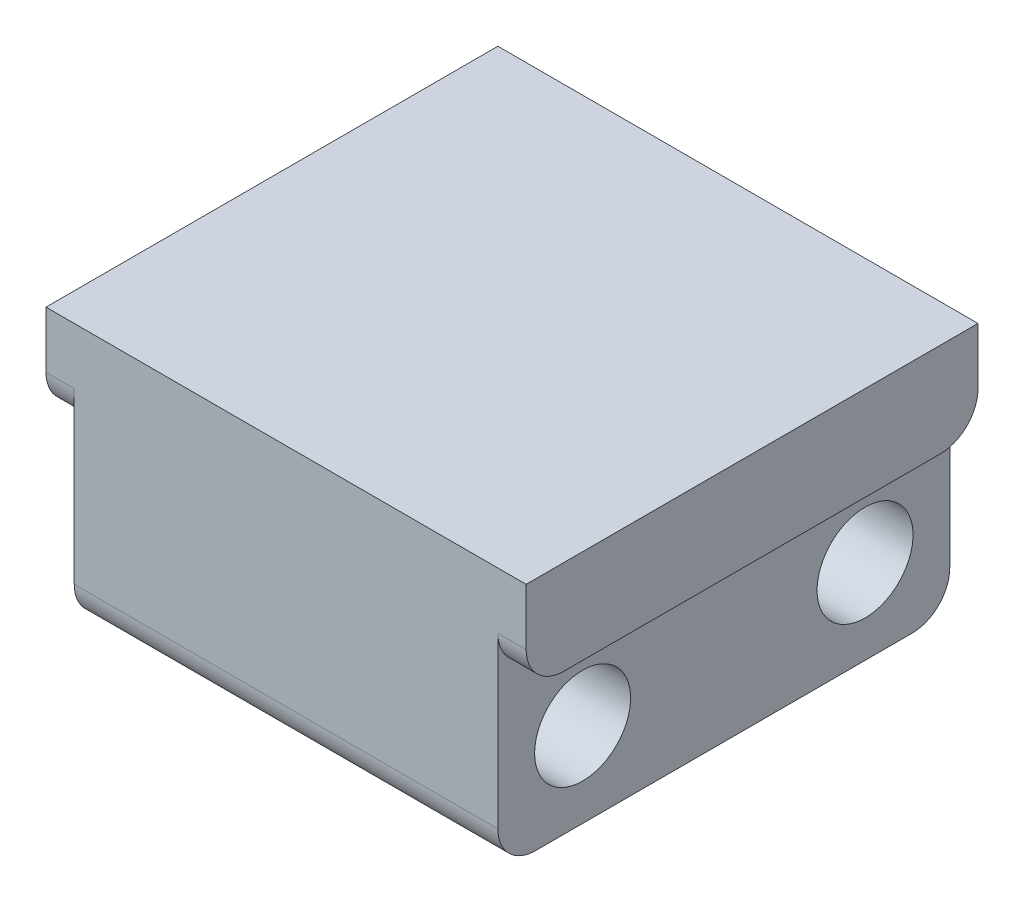
ISO-10303-21;
HEADER;
FILE_DESCRIPTION(('STEP AP214'),'2;1');
FILE_NAME('part.step','',(''),(''),'','','');
FILE_SCHEMA(('AUTOMOTIVE_DESIGN { 1 0 10303 214 1 1 1 1 }'));
ENDSEC;
DATA;
#1=APPLICATION_CONTEXT('core data for automotive mechanical design processes');
#2=APPLICATION_PROTOCOL_DEFINITION('international standard','automotive_design',2000,#1);
#3=PRODUCT_CONTEXT('',#1,'mechanical');
#4=PRODUCT('Part','Part','',(#3));
#5=PRODUCT_RELATED_PRODUCT_CATEGORY('part','',(#4));
#6=PRODUCT_DEFINITION_FORMATION('','',#4);
#7=PRODUCT_DEFINITION_CONTEXT('part definition',#1,'design');
#8=PRODUCT_DEFINITION('design','',#6,#7);
#9=PRODUCT_DEFINITION_SHAPE('','',#8);
#10=(LENGTH_UNIT() NAMED_UNIT(*) SI_UNIT(.MILLI.,.METRE.));
#11=(NAMED_UNIT(*) PLANE_ANGLE_UNIT() SI_UNIT($,.RADIAN.));
#12=(NAMED_UNIT(*) SI_UNIT($,.STERADIAN.) SOLID_ANGLE_UNIT());
#13=UNCERTAINTY_MEASURE_WITH_UNIT(LENGTH_MEASURE(1.E-05),#10,'distance_accuracy_value','');
#14=(GEOMETRIC_REPRESENTATION_CONTEXT(3) GLOBAL_UNCERTAINTY_ASSIGNED_CONTEXT((#13)) GLOBAL_UNIT_ASSIGNED_CONTEXT((#10,
#11,#12)) REPRESENTATION_CONTEXT('',''));
#15=CARTESIAN_POINT('',(0.,0.,0.));
#16=DIRECTION('',(0.,0.,1.));
#17=DIRECTION('',(1.,0.,0.));
#18=AXIS2_PLACEMENT_3D('',#15,#16,#17);
#19=CARTESIAN_POINT('',(11.25,9.,12.));
#20=DIRECTION('',(0.,1.,0.));
#21=DIRECTION('',(0.,0.,1.));
#22=AXIS2_PLACEMENT_3D('',#19,#20,#21);
#23=PLANE('',#22);
#24=DIRECTION('',(0.,0.,-1.));
#25=VECTOR('',#24,1.);
#26=CARTESIAN_POINT('',(12.75,9.,12.));
#27=LINE('',#26,#25);
#28=CARTESIAN_POINT('',(12.75,9.,10.));
#29=VERTEX_POINT('',#28);
#30=CARTESIAN_POINT('',(12.75,9.,-10.));
#31=VERTEX_POINT('',#30);
#32=EDGE_CURVE('E154',#29,#31,#27,.T.);
#33=ORIENTED_EDGE('',*,*,#32,.F.);
#34=DIRECTION('',(1.,0.,0.));
#35=VECTOR('',#34,1.);
#36=CARTESIAN_POINT('',(11.25,9.,10.));
#37=LINE('',#36,#35);
#38=CARTESIAN_POINT('',(11.25,9.,10.));
#39=VERTEX_POINT('',#38);
#40=EDGE_CURVE('E218',#29,#39,#37,.F.);
#41=ORIENTED_EDGE('',*,*,#40,.T.);
#42=DIRECTION('',(0.,0.,-1.));
#43=VECTOR('',#42,1.);
#44=CARTESIAN_POINT('',(11.25,9.,12.));
#45=LINE('',#44,#43);
#46=CARTESIAN_POINT('',(11.25,9.,-10.));
#47=VERTEX_POINT('',#46);
#48=EDGE_CURVE('E170',#39,#47,#45,.T.);
#49=ORIENTED_EDGE('',*,*,#48,.T.);
#50=DIRECTION('',(1.,0.,0.));
#51=VECTOR('',#50,1.);
#52=CARTESIAN_POINT('',(11.25,9.,-10.));
#53=LINE('',#52,#51);
#54=EDGE_CURVE('E215',#47,#31,#53,.T.);
#55=ORIENTED_EDGE('',*,*,#54,.T.);
#56=EDGE_LOOP('',(#33,#41,#49,#55));
#57=FACE_BOUND('',#56,.T.);
#58=ADVANCED_FACE('F32',(#57),#23,.F.);
#59=CARTESIAN_POINT('',(12.75,9.,12.));
#60=DIRECTION('',(-1.,0.,0.));
#61=DIRECTION('',(0.,0.,1.));
#62=AXIS2_PLACEMENT_3D('',#59,#60,#61);
#63=PLANE('',#62);
#64=DIRECTION('',(0.,1.,0.));
#65=VECTOR('',#64,1.);
#66=CARTESIAN_POINT('',(12.75,9.,12.));
#67=LINE('',#66,#65);
#68=CARTESIAN_POINT('',(12.75,11.,12.));
#69=VERTEX_POINT('',#68);
#70=CARTESIAN_POINT('',(12.75,14.,12.));
#71=VERTEX_POINT('',#70);
#72=EDGE_CURVE('E135',#69,#71,#67,.T.);
#73=ORIENTED_EDGE('',*,*,#72,.F.);
#74=CARTESIAN_POINT('',(12.75,11.,10.));
#75=DIRECTION('',(-1.,0.,0.));
#76=DIRECTION('',(0.,0.,1.));
#77=AXIS2_PLACEMENT_3D('',#74,#75,#76);
#78=CIRCLE('',#77,2.);
#79=EDGE_CURVE('E213',#69,#29,#78,.F.);
#80=ORIENTED_EDGE('',*,*,#79,.T.);
#81=ORIENTED_EDGE('',*,*,#32,.T.);
#82=CARTESIAN_POINT('',(12.75,11.,-10.));
#83=DIRECTION('',(-1.,0.,0.));
#84=DIRECTION('',(0.,0.,1.));
#85=AXIS2_PLACEMENT_3D('',#82,#83,#84);
#86=CIRCLE('',#85,2.);
#87=CARTESIAN_POINT('',(12.75,11.,-12.));
#88=VERTEX_POINT('',#87);
#89=EDGE_CURVE('E211',#31,#88,#86,.F.);
#90=ORIENTED_EDGE('',*,*,#89,.T.);
#91=DIRECTION('',(0.,1.,0.));
#92=VECTOR('',#91,1.);
#93=CARTESIAN_POINT('',(12.75,9.,-12.));
#94=LINE('',#93,#92);
#95=CARTESIAN_POINT('',(12.75,14.,-12.));
#96=VERTEX_POINT('',#95);
#97=EDGE_CURVE('E151',#88,#96,#94,.T.);
#98=ORIENTED_EDGE('',*,*,#97,.T.);
#99=DIRECTION('',(0.,0.,-1.));
#100=VECTOR('',#99,1.);
#101=CARTESIAN_POINT('',(12.75,14.,12.));
#102=LINE('',#101,#100);
#103=EDGE_CURVE('E148',#71,#96,#102,.T.);
#104=ORIENTED_EDGE('',*,*,#103,.F.);
#105=EDGE_LOOP('',(#73,#80,#81,#90,#98,#104));
#106=FACE_BOUND('',#105,.T.);
#107=ADVANCED_FACE('F149',(#106),#63,.F.);
#108=CARTESIAN_POINT('',(-12.75,14.,12.));
#109=DIRECTION('',(0.,-1.,0.));
#110=DIRECTION('',(0.,0.,-1.));
#111=AXIS2_PLACEMENT_3D('',#108,#109,#110);
#112=PLANE('',#111);
#113=DIRECTION('',(-1.,0.,0.));
#114=VECTOR('',#113,1.);
#115=CARTESIAN_POINT('',(-12.75,14.,-12.));
#116=LINE('',#115,#114);
#117=CARTESIAN_POINT('',(-12.75,14.,-12.));
#118=VERTEX_POINT('',#117);
#119=EDGE_CURVE('E172',#96,#118,#116,.T.);
#120=ORIENTED_EDGE('',*,*,#119,.T.);
#121=DIRECTION('',(0.,0.,-1.));
#122=VECTOR('',#121,1.);
#123=CARTESIAN_POINT('',(-12.75,14.,12.));
#124=LINE('',#123,#122);
#125=CARTESIAN_POINT('',(-12.75,14.,12.));
#126=VERTEX_POINT('',#125);
#127=EDGE_CURVE('E155',#126,#118,#124,.T.);
#128=ORIENTED_EDGE('',*,*,#127,.F.);
#129=DIRECTION('',(-1.,0.,0.));
#130=VECTOR('',#129,1.);
#131=CARTESIAN_POINT('',(-12.75,14.,12.));
#132=LINE('',#131,#130);
#133=EDGE_CURVE('E140',#71,#126,#132,.T.);
#134=ORIENTED_EDGE('',*,*,#133,.F.);
#135=ORIENTED_EDGE('',*,*,#103,.T.);
#136=EDGE_LOOP('',(#120,#128,#134,#135));
#137=FACE_BOUND('',#136,.T.);
#138=ADVANCED_FACE('F157',(#137),#112,.F.);
#139=CARTESIAN_POINT('',(-12.75,9.,12.));
#140=DIRECTION('',(1.,0.,0.));
#141=DIRECTION('',(0.,0.,-1.));
#142=AXIS2_PLACEMENT_3D('',#139,#140,#141);
#143=PLANE('',#142);
#144=DIRECTION('',(0.,0.,-1.));
#145=VECTOR('',#144,1.);
#146=CARTESIAN_POINT('',(-12.75,9.,12.));
#147=LINE('',#146,#145);
#148=CARTESIAN_POINT('',(-12.75,9.,10.));
#149=VERTEX_POINT('',#148);
#150=CARTESIAN_POINT('',(-12.75,9.,-10.));
#151=VERTEX_POINT('',#150);
#152=EDGE_CURVE('E191',#149,#151,#147,.T.);
#153=ORIENTED_EDGE('',*,*,#152,.F.);
#154=CARTESIAN_POINT('',(-12.75,11.,10.));
#155=DIRECTION('',(1.,0.,0.));
#156=DIRECTION('',(0.,0.,-1.));
#157=AXIS2_PLACEMENT_3D('',#154,#155,#156);
#158=CIRCLE('',#157,2.);
#159=CARTESIAN_POINT('',(-12.75,11.,12.));
#160=VERTEX_POINT('',#159);
#161=EDGE_CURVE('E227',#149,#160,#158,.F.);
#162=ORIENTED_EDGE('',*,*,#161,.T.);
#163=DIRECTION('',(0.,-1.,0.));
#164=VECTOR('',#163,1.);
#165=CARTESIAN_POINT('',(-12.75,9.,12.));
#166=LINE('',#165,#164);
#167=EDGE_CURVE('E160',#126,#160,#166,.T.);
#168=ORIENTED_EDGE('',*,*,#167,.F.);
#169=ORIENTED_EDGE('',*,*,#127,.T.);
#170=DIRECTION('',(0.,-1.,0.));
#171=VECTOR('',#170,1.);
#172=CARTESIAN_POINT('',(-12.75,9.,-12.));
#173=LINE('',#172,#171);
#174=CARTESIAN_POINT('',(-12.75,11.,-12.));
#175=VERTEX_POINT('',#174);
#176=EDGE_CURVE('E175',#118,#175,#173,.T.);
#177=ORIENTED_EDGE('',*,*,#176,.T.);
#178=CARTESIAN_POINT('',(-12.75,11.,-10.));
#179=DIRECTION('',(1.,0.,0.));
#180=DIRECTION('',(0.,0.,-1.));
#181=AXIS2_PLACEMENT_3D('',#178,#179,#180);
#182=CIRCLE('',#181,2.);
#183=EDGE_CURVE('E225',#175,#151,#182,.F.);
#184=ORIENTED_EDGE('',*,*,#183,.T.);
#185=EDGE_LOOP('',(#153,#162,#168,#169,#177,#184));
#186=FACE_BOUND('',#185,.T.);
#187=ADVANCED_FACE('F269',(#186),#143,.F.);
#188=CARTESIAN_POINT('',(-11.25,9.,12.));
#189=DIRECTION('',(0.,1.,0.));
#190=DIRECTION('',(0.,0.,1.));
#191=AXIS2_PLACEMENT_3D('',#188,#189,#190);
#192=PLANE('',#191);
#193=DIRECTION('',(0.,0.,-1.));
#194=VECTOR('',#193,1.);
#195=CARTESIAN_POINT('',(-11.25,9.,12.));
#196=LINE('',#195,#194);
#197=CARTESIAN_POINT('',(-11.25,9.,10.));
#198=VERTEX_POINT('',#197);
#199=CARTESIAN_POINT('',(-11.25,9.,-10.));
#200=VERTEX_POINT('',#199);
#201=EDGE_CURVE('E188',#198,#200,#196,.T.);
#202=ORIENTED_EDGE('',*,*,#201,.F.);
#203=DIRECTION('',(1.,0.,0.));
#204=VECTOR('',#203,1.);
#205=CARTESIAN_POINT('',(-12.75,9.,10.));
#206=LINE('',#205,#204);
#207=EDGE_CURVE('E223',#198,#149,#206,.F.);
#208=ORIENTED_EDGE('',*,*,#207,.T.);
#209=ORIENTED_EDGE('',*,*,#152,.T.);
#210=DIRECTION('',(1.,0.,0.));
#211=VECTOR('',#210,1.);
#212=CARTESIAN_POINT('',(-11.25,9.,-10.));
#213=LINE('',#212,#211);
#214=EDGE_CURVE('E220',#151,#200,#213,.T.);
#215=ORIENTED_EDGE('',*,*,#214,.T.);
#216=EDGE_LOOP('',(#202,#208,#209,#215));
#217=FACE_BOUND('',#216,.T.);
#218=ADVANCED_FACE('F280',(#217),#192,.F.);
#219=CARTESIAN_POINT('',(-11.25,0.,12.));
#220=DIRECTION('',(1.,0.,0.));
#221=DIRECTION('',(0.,0.,-1.));
#222=AXIS2_PLACEMENT_3D('',#219,#220,#221);
#223=PLANE('',#222);
#224=CARTESIAN_POINT('',(-11.25,4.5,7.5));
#225=DIRECTION('',(-1.,0.,0.));
#226=DIRECTION('',(0.,0.,1.));
#227=AXIS2_PLACEMENT_3D('',#224,#225,#226);
#228=CIRCLE('',#227,2.55);
#229=CARTESIAN_POINT('',(-11.25,4.5,10.05));
#230=VERTEX_POINT('',#229);
#231=EDGE_CURVE('E204',#230,#230,#228,.T.);
#232=ORIENTED_EDGE('',*,*,#231,.F.);
#233=EDGE_LOOP('',(#232));
#234=FACE_BOUND('',#233,.T.);
#235=CARTESIAN_POINT('',(-11.25,4.5,-7.5));
#236=DIRECTION('',(-1.,0.,0.));
#237=DIRECTION('',(0.,0.,1.));
#238=AXIS2_PLACEMENT_3D('',#235,#236,#237);
#239=CIRCLE('',#238,2.55);
#240=CARTESIAN_POINT('',(-11.25,4.5,-4.95));
#241=VERTEX_POINT('',#240);
#242=EDGE_CURVE('E200',#241,#241,#239,.T.);
#243=ORIENTED_EDGE('',*,*,#242,.F.);
#244=EDGE_LOOP('',(#243));
#245=FACE_BOUND('',#244,.T.);
#246=DIRECTION('',(0.,-1.,0.));
#247=VECTOR('',#246,1.);
#248=CARTESIAN_POINT('',(-11.25,0.,-12.));
#249=LINE('',#248,#247);
#250=CARTESIAN_POINT('',(-11.25,11.,-12.));
#251=VERTEX_POINT('',#250);
#252=CARTESIAN_POINT('',(-11.25,2.,-12.));
#253=VERTEX_POINT('',#252);
#254=EDGE_CURVE('E178',#251,#253,#249,.T.);
#255=ORIENTED_EDGE('',*,*,#254,.T.);
#256=CARTESIAN_POINT('',(-11.25,2.,-10.));
#257=DIRECTION('',(1.,0.,0.));
#258=DIRECTION('',(0.,0.,-1.));
#259=AXIS2_PLACEMENT_3D('',#256,#257,#258);
#260=CIRCLE('',#259,2.);
#261=CARTESIAN_POINT('',(-11.25,0.,-10.));
#262=VERTEX_POINT('',#261);
#263=EDGE_CURVE('E47',#253,#262,#260,.F.);
#264=ORIENTED_EDGE('',*,*,#263,.T.);
#265=DIRECTION('',(0.,0.,-1.));
#266=VECTOR('',#265,1.);
#267=CARTESIAN_POINT('',(-11.25,0.,12.));
#268=LINE('',#267,#266);
#269=CARTESIAN_POINT('',(-11.25,0.,10.));
#270=VERTEX_POINT('',#269);
#271=EDGE_CURVE('E186',#270,#262,#268,.T.);
#272=ORIENTED_EDGE('',*,*,#271,.F.);
#273=CARTESIAN_POINT('',(-11.25,2.,10.));
#274=DIRECTION('',(1.,0.,0.));
#275=DIRECTION('',(0.,0.,-1.));
#276=AXIS2_PLACEMENT_3D('',#273,#274,#275);
#277=CIRCLE('',#276,2.);
#278=CARTESIAN_POINT('',(-11.25,2.,12.));
#279=VERTEX_POINT('',#278);
#280=EDGE_CURVE('E244',#270,#279,#277,.F.);
#281=ORIENTED_EDGE('',*,*,#280,.T.);
#282=DIRECTION('',(0.,-1.,0.));
#283=VECTOR('',#282,1.);
#284=CARTESIAN_POINT('',(-11.25,0.,12.));
#285=LINE('',#284,#283);
#286=CARTESIAN_POINT('',(-11.25,11.,12.));
#287=VERTEX_POINT('',#286);
#288=EDGE_CURVE('E162',#287,#279,#285,.T.);
#289=ORIENTED_EDGE('',*,*,#288,.F.);
#290=CARTESIAN_POINT('',(-11.25,11.,10.));
#291=DIRECTION('',(1.,0.,0.));
#292=DIRECTION('',(0.,0.,-1.));
#293=AXIS2_PLACEMENT_3D('',#290,#291,#292);
#294=CIRCLE('',#293,2.);
#295=EDGE_CURVE('E250',#287,#198,#294,.T.);
#296=ORIENTED_EDGE('',*,*,#295,.T.);
#297=ORIENTED_EDGE('',*,*,#201,.T.);
#298=CARTESIAN_POINT('',(-11.25,11.,-10.));
#299=DIRECTION('',(1.,0.,0.));
#300=DIRECTION('',(0.,0.,-1.));
#301=AXIS2_PLACEMENT_3D('',#298,#299,#300);
#302=CIRCLE('',#301,2.);
#303=EDGE_CURVE('E11',#200,#251,#302,.T.);
#304=ORIENTED_EDGE('',*,*,#303,.T.);
#305=EDGE_LOOP('',(#255,#264,#272,#281,#289,#296,#297,#304));
#306=FACE_BOUND('',#305,.T.);
#307=ADVANCED_FACE('F278',(#234,#245,#306),#223,.F.);
#308=CARTESIAN_POINT('',(11.25,0.,12.));
#309=DIRECTION('',(0.,1.,0.));
#310=DIRECTION('',(0.,0.,1.));
#311=AXIS2_PLACEMENT_3D('',#308,#309,#310);
#312=PLANE('',#311);
#313=ORIENTED_EDGE('',*,*,#271,.T.);
#314=DIRECTION('',(1.,0.,0.));
#315=VECTOR('',#314,1.);
#316=CARTESIAN_POINT('',(11.25,0.,-10.));
#317=LINE('',#316,#315);
#318=CARTESIAN_POINT('',(11.25,0.,-10.));
#319=VERTEX_POINT('',#318);
#320=EDGE_CURVE('E237',#262,#319,#317,.T.);
#321=ORIENTED_EDGE('',*,*,#320,.T.);
#322=DIRECTION('',(0.,0.,-1.));
#323=VECTOR('',#322,1.);
#324=CARTESIAN_POINT('',(11.25,0.,12.));
#325=LINE('',#324,#323);
#326=CARTESIAN_POINT('',(11.25,0.,10.));
#327=VERTEX_POINT('',#326);
#328=EDGE_CURVE('E183',#327,#319,#325,.T.);
#329=ORIENTED_EDGE('',*,*,#328,.F.);
#330=DIRECTION('',(1.,0.,0.));
#331=VECTOR('',#330,1.);
#332=CARTESIAN_POINT('',(-11.25,0.,10.));
#333=LINE('',#332,#331);
#334=EDGE_CURVE('E54',#327,#270,#333,.F.);
#335=ORIENTED_EDGE('',*,*,#334,.T.);
#336=EDGE_LOOP('',(#313,#321,#329,#335));
#337=FACE_BOUND('',#336,.T.);
#338=ADVANCED_FACE('F289',(#337),#312,.F.);
#339=CARTESIAN_POINT('',(11.25,0.,12.));
#340=DIRECTION('',(-1.,0.,0.));
#341=DIRECTION('',(0.,0.,1.));
#342=AXIS2_PLACEMENT_3D('',#339,#340,#341);
#343=PLANE('',#342);
#344=CARTESIAN_POINT('',(11.25,4.5,7.5));
#345=DIRECTION('',(-1.,0.,0.));
#346=DIRECTION('',(0.,0.,1.));
#347=AXIS2_PLACEMENT_3D('',#344,#345,#346);
#348=CIRCLE('',#347,2.55);
#349=CARTESIAN_POINT('',(11.25,4.5,10.05));
#350=VERTEX_POINT('',#349);
#351=EDGE_CURVE('E201',#350,#350,#348,.T.);
#352=ORIENTED_EDGE('',*,*,#351,.T.);
#353=EDGE_LOOP('',(#352));
#354=FACE_BOUND('',#353,.T.);
#355=CARTESIAN_POINT('',(11.25,4.5,-7.5));
#356=DIRECTION('',(-1.,0.,0.));
#357=DIRECTION('',(0.,0.,1.));
#358=AXIS2_PLACEMENT_3D('',#355,#356,#357);
#359=CIRCLE('',#358,2.55);
#360=CARTESIAN_POINT('',(11.25,4.5,-4.95));
#361=VERTEX_POINT('',#360);
#362=EDGE_CURVE('E173',#361,#361,#359,.T.);
#363=ORIENTED_EDGE('',*,*,#362,.T.);
#364=EDGE_LOOP('',(#363));
#365=FACE_BOUND('',#364,.T.);
#366=ORIENTED_EDGE('',*,*,#328,.T.);
#367=CARTESIAN_POINT('',(11.25,2.,-10.));
#368=DIRECTION('',(-1.,0.,0.));
#369=DIRECTION('',(0.,0.,1.));
#370=AXIS2_PLACEMENT_3D('',#367,#368,#369);
#371=CIRCLE('',#370,2.);
#372=CARTESIAN_POINT('',(11.25,2.,-12.));
#373=VERTEX_POINT('',#372);
#374=EDGE_CURVE('E242',#319,#373,#371,.F.);
#375=ORIENTED_EDGE('',*,*,#374,.T.);
#376=DIRECTION('',(0.,1.,0.));
#377=VECTOR('',#376,1.);
#378=CARTESIAN_POINT('',(11.25,0.,-12.));
#379=LINE('',#378,#377);
#380=CARTESIAN_POINT('',(11.25,11.,-12.));
#381=VERTEX_POINT('',#380);
#382=EDGE_CURVE('E145',#373,#381,#379,.T.);
#383=ORIENTED_EDGE('',*,*,#382,.T.);
#384=CARTESIAN_POINT('',(11.25,11.,-10.));
#385=DIRECTION('',(-1.,0.,0.));
#386=DIRECTION('',(0.,0.,1.));
#387=AXIS2_PLACEMENT_3D('',#384,#385,#386);
#388=CIRCLE('',#387,2.);
#389=EDGE_CURVE('E40',#381,#47,#388,.T.);
#390=ORIENTED_EDGE('',*,*,#389,.T.);
#391=ORIENTED_EDGE('',*,*,#48,.F.);
#392=CARTESIAN_POINT('',(11.25,11.,10.));
#393=DIRECTION('',(-1.,0.,0.));
#394=DIRECTION('',(0.,0.,1.));
#395=AXIS2_PLACEMENT_3D('',#392,#393,#394);
#396=CIRCLE('',#395,2.);
#397=CARTESIAN_POINT('',(11.25,11.,12.));
#398=VERTEX_POINT('',#397);
#399=EDGE_CURVE('E247',#39,#398,#396,.T.);
#400=ORIENTED_EDGE('',*,*,#399,.T.);
#401=DIRECTION('',(0.,1.,0.));
#402=VECTOR('',#401,1.);
#403=CARTESIAN_POINT('',(11.25,0.,12.));
#404=LINE('',#403,#402);
#405=CARTESIAN_POINT('',(11.25,2.,12.));
#406=VERTEX_POINT('',#405);
#407=EDGE_CURVE('E168',#406,#398,#404,.T.);
#408=ORIENTED_EDGE('',*,*,#407,.F.);
#409=CARTESIAN_POINT('',(11.25,2.,10.));
#410=DIRECTION('',(-1.,0.,0.));
#411=DIRECTION('',(0.,0.,1.));
#412=AXIS2_PLACEMENT_3D('',#409,#410,#411);
#413=CIRCLE('',#412,2.);
#414=EDGE_CURVE('E240',#406,#327,#413,.F.);
#415=ORIENTED_EDGE('',*,*,#414,.T.);
#416=EDGE_LOOP('',(#366,#375,#383,#390,#391,#400,#408,#415));
#417=FACE_BOUND('',#416,.T.);
#418=ADVANCED_FACE('F254',(#354,#365,#417),#343,.F.);
#419=CARTESIAN_POINT('',(0.,0.,12.));
#420=DIRECTION('',(0.,0.,1.));
#421=DIRECTION('',(1.,0.,0.));
#422=AXIS2_PLACEMENT_3D('',#419,#420,#421);
#423=PLANE('',#422);
#424=ORIENTED_EDGE('',*,*,#407,.T.);
#425=DIRECTION('',(1.,0.,0.));
#426=VECTOR('',#425,1.);
#427=CARTESIAN_POINT('',(12.75,11.,12.));
#428=LINE('',#427,#426);
#429=EDGE_CURVE('E143',#398,#69,#428,.T.);
#430=ORIENTED_EDGE('',*,*,#429,.T.);
#431=ORIENTED_EDGE('',*,*,#72,.T.);
#432=ORIENTED_EDGE('',*,*,#133,.T.);
#433=ORIENTED_EDGE('',*,*,#167,.T.);
#434=DIRECTION('',(1.,0.,0.));
#435=VECTOR('',#434,1.);
#436=CARTESIAN_POINT('',(-11.25,11.,12.));
#437=LINE('',#436,#435);
#438=EDGE_CURVE('E207',#160,#287,#437,.T.);
#439=ORIENTED_EDGE('',*,*,#438,.T.);
#440=ORIENTED_EDGE('',*,*,#288,.T.);
#441=DIRECTION('',(1.,0.,0.));
#442=VECTOR('',#441,1.);
#443=CARTESIAN_POINT('',(11.25,2.,12.));
#444=LINE('',#443,#442);
#445=EDGE_CURVE('E197',#279,#406,#444,.T.);
#446=ORIENTED_EDGE('',*,*,#445,.T.);
#447=EDGE_LOOP('',(#424,#430,#431,#432,#433,#439,#440,#446));
#448=FACE_BOUND('',#447,.T.);
#449=ADVANCED_FACE('F137',(#448),#423,.T.);
#450=CARTESIAN_POINT('',(0.,0.,-12.));
#451=DIRECTION('',(0.,0.,1.));
#452=DIRECTION('',(1.,0.,0.));
#453=AXIS2_PLACEMENT_3D('',#450,#451,#452);
#454=PLANE('',#453);
#455=ORIENTED_EDGE('',*,*,#97,.F.);
#456=DIRECTION('',(1.,0.,0.));
#457=VECTOR('',#456,1.);
#458=CARTESIAN_POINT('',(0.,11.,-12.));
#459=LINE('',#458,#457);
#460=EDGE_CURVE('E233',#88,#381,#459,.F.);
#461=ORIENTED_EDGE('',*,*,#460,.T.);
#462=ORIENTED_EDGE('',*,*,#382,.F.);
#463=DIRECTION('',(1.,0.,0.));
#464=VECTOR('',#463,1.);
#465=CARTESIAN_POINT('',(0.,2.,-12.));
#466=LINE('',#465,#464);
#467=EDGE_CURVE('E229',#373,#253,#466,.F.);
#468=ORIENTED_EDGE('',*,*,#467,.T.);
#469=ORIENTED_EDGE('',*,*,#254,.F.);
#470=DIRECTION('',(1.,0.,0.));
#471=VECTOR('',#470,1.);
#472=CARTESIAN_POINT('',(0.,11.,-12.));
#473=LINE('',#472,#471);
#474=EDGE_CURVE('E231',#251,#175,#473,.F.);
#475=ORIENTED_EDGE('',*,*,#474,.T.);
#476=ORIENTED_EDGE('',*,*,#176,.F.);
#477=ORIENTED_EDGE('',*,*,#119,.F.);
#478=EDGE_LOOP('',(#455,#461,#462,#468,#469,#475,#476,#477));
#479=FACE_BOUND('',#478,.T.);
#480=ADVANCED_FACE('F265',(#479),#454,.F.);
#481=CARTESIAN_POINT('',(12.75,4.5,-7.5));
#482=DIRECTION('',(-1.,0.,0.));
#483=DIRECTION('',(0.,0.,1.));
#484=AXIS2_PLACEMENT_3D('',#481,#482,#483);
#485=CYLINDRICAL_SURFACE('',#484,2.55);
#486=ORIENTED_EDGE('',*,*,#242,.T.);
#487=EDGE_LOOP('',(#486));
#488=FACE_BOUND('',#487,.T.);
#489=ORIENTED_EDGE('',*,*,#362,.F.);
#490=EDGE_LOOP('',(#489));
#491=FACE_BOUND('',#490,.T.);
#492=ADVANCED_FACE('F304',(#488,#491),#485,.F.);
#493=CARTESIAN_POINT('',(12.75,4.5,7.5));
#494=DIRECTION('',(-1.,0.,0.));
#495=DIRECTION('',(0.,0.,1.));
#496=AXIS2_PLACEMENT_3D('',#493,#494,#495);
#497=CYLINDRICAL_SURFACE('',#496,2.55);
#498=ORIENTED_EDGE('',*,*,#231,.T.);
#499=EDGE_LOOP('',(#498));
#500=FACE_BOUND('',#499,.T.);
#501=ORIENTED_EDGE('',*,*,#351,.F.);
#502=EDGE_LOOP('',(#501));
#503=FACE_BOUND('',#502,.T.);
#504=ADVANCED_FACE('F297',(#500,#503),#497,.F.);
#505=CARTESIAN_POINT('',(0.,11.,10.));
#506=DIRECTION('',(-1.,0.,0.));
#507=DIRECTION('',(0.,0.,1.));
#508=AXIS2_PLACEMENT_3D('',#505,#506,#507);
#509=CYLINDRICAL_SURFACE('',#508,2.);
#510=ORIENTED_EDGE('',*,*,#399,.F.);
#511=ORIENTED_EDGE('',*,*,#40,.F.);
#512=ORIENTED_EDGE('',*,*,#79,.F.);
#513=ORIENTED_EDGE('',*,*,#429,.F.);
#514=EDGE_LOOP('',(#510,#511,#512,#513));
#515=FACE_BOUND('',#514,.T.);
#516=ADVANCED_FACE('F295',(#515),#509,.T.);
#517=CARTESIAN_POINT('',(0.,11.,10.));
#518=DIRECTION('',(-1.,0.,0.));
#519=DIRECTION('',(0.,0.,1.));
#520=AXIS2_PLACEMENT_3D('',#517,#518,#519);
#521=CYLINDRICAL_SURFACE('',#520,2.);
#522=ORIENTED_EDGE('',*,*,#161,.F.);
#523=ORIENTED_EDGE('',*,*,#207,.F.);
#524=ORIENTED_EDGE('',*,*,#295,.F.);
#525=ORIENTED_EDGE('',*,*,#438,.F.);
#526=EDGE_LOOP('',(#522,#523,#524,#525));
#527=FACE_BOUND('',#526,.T.);
#528=ADVANCED_FACE('F275',(#527),#521,.T.);
#529=CARTESIAN_POINT('',(11.25,11.,-10.));
#530=DIRECTION('',(1.,0.,0.));
#531=DIRECTION('',(0.,0.,-1.));
#532=AXIS2_PLACEMENT_3D('',#529,#530,#531);
#533=CYLINDRICAL_SURFACE('',#532,2.);
#534=ORIENTED_EDGE('',*,*,#389,.F.);
#535=ORIENTED_EDGE('',*,*,#460,.F.);
#536=ORIENTED_EDGE('',*,*,#89,.F.);
#537=ORIENTED_EDGE('',*,*,#54,.F.);
#538=EDGE_LOOP('',(#534,#535,#536,#537));
#539=FACE_BOUND('',#538,.T.);
#540=ADVANCED_FACE('F263',(#539),#533,.T.);
#541=CARTESIAN_POINT('',(-11.25,11.,-10.));
#542=DIRECTION('',(1.,0.,0.));
#543=DIRECTION('',(0.,0.,-1.));
#544=AXIS2_PLACEMENT_3D('',#541,#542,#543);
#545=CYLINDRICAL_SURFACE('',#544,2.);
#546=ORIENTED_EDGE('',*,*,#183,.F.);
#547=ORIENTED_EDGE('',*,*,#474,.F.);
#548=ORIENTED_EDGE('',*,*,#303,.F.);
#549=ORIENTED_EDGE('',*,*,#214,.F.);
#550=EDGE_LOOP('',(#546,#547,#548,#549));
#551=FACE_BOUND('',#550,.T.);
#552=ADVANCED_FACE('F283',(#551),#545,.T.);
#553=CARTESIAN_POINT('',(11.25,2.,-10.));
#554=DIRECTION('',(1.,0.,0.));
#555=DIRECTION('',(0.,0.,-1.));
#556=AXIS2_PLACEMENT_3D('',#553,#554,#555);
#557=CYLINDRICAL_SURFACE('',#556,2.);
#558=ORIENTED_EDGE('',*,*,#263,.F.);
#559=ORIENTED_EDGE('',*,*,#467,.F.);
#560=ORIENTED_EDGE('',*,*,#374,.F.);
#561=ORIENTED_EDGE('',*,*,#320,.F.);
#562=EDGE_LOOP('',(#558,#559,#560,#561));
#563=FACE_BOUND('',#562,.T.);
#564=ADVANCED_FACE('F288',(#563),#557,.T.);
#565=CARTESIAN_POINT('',(0.,2.,10.));
#566=DIRECTION('',(-1.,0.,0.));
#567=DIRECTION('',(0.,0.,1.));
#568=AXIS2_PLACEMENT_3D('',#565,#566,#567);
#569=CYLINDRICAL_SURFACE('',#568,2.);
#570=ORIENTED_EDGE('',*,*,#280,.F.);
#571=ORIENTED_EDGE('',*,*,#334,.F.);
#572=ORIENTED_EDGE('',*,*,#414,.F.);
#573=ORIENTED_EDGE('',*,*,#445,.F.);
#574=EDGE_LOOP('',(#570,#571,#572,#573));
#575=FACE_BOUND('',#574,.T.);
#576=ADVANCED_FACE('F34',(#575),#569,.T.);
#577=CLOSED_SHELL('',(#58,#107,#138,#187,#218,#307,#338,#418,#449,#480,#492,#504,#516,#528,#540,
#552,#564,#576));
#578=MANIFOLD_SOLID_BREP('B2',#577);
#579=ADVANCED_BREP_SHAPE_REPRESENTATION('',(#18,#578),#14);
#580=SHAPE_DEFINITION_REPRESENTATION(#9,#579);
ENDSEC;
END-ISO-10303-21;
